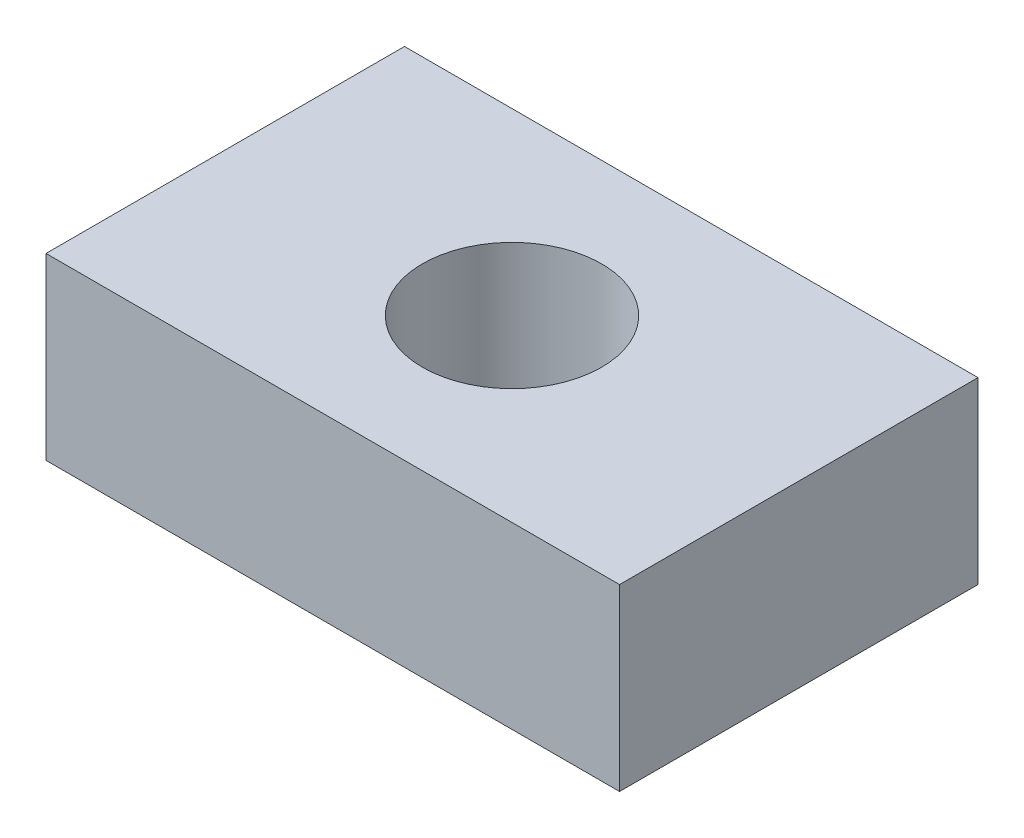
ISO-10303-21;
HEADER;
FILE_DESCRIPTION(('STEP AP214'),'2;1');
FILE_NAME('part.step','',(''),(''),'','','');
FILE_SCHEMA(('AUTOMOTIVE_DESIGN { 1 0 10303 214 1 1 1 1 }'));
ENDSEC;
DATA;
#1=APPLICATION_CONTEXT('core data for automotive mechanical design processes');
#2=APPLICATION_PROTOCOL_DEFINITION('international standard','automotive_design',2000,#1);
#3=PRODUCT_CONTEXT('',#1,'mechanical');
#4=PRODUCT('Part','Part','',(#3));
#5=PRODUCT_RELATED_PRODUCT_CATEGORY('part','',(#4));
#6=PRODUCT_DEFINITION_FORMATION('','',#4);
#7=PRODUCT_DEFINITION_CONTEXT('part definition',#1,'design');
#8=PRODUCT_DEFINITION('design','',#6,#7);
#9=PRODUCT_DEFINITION_SHAPE('','',#8);
#10=(LENGTH_UNIT() NAMED_UNIT(*) SI_UNIT(.MILLI.,.METRE.));
#11=(NAMED_UNIT(*) PLANE_ANGLE_UNIT() SI_UNIT($,.RADIAN.));
#12=(NAMED_UNIT(*) SI_UNIT($,.STERADIAN.) SOLID_ANGLE_UNIT());
#13=UNCERTAINTY_MEASURE_WITH_UNIT(LENGTH_MEASURE(1.E-05),#10,'distance_accuracy_value','');
#14=(GEOMETRIC_REPRESENTATION_CONTEXT(3) GLOBAL_UNCERTAINTY_ASSIGNED_CONTEXT((#13)) GLOBAL_UNIT_ASSIGNED_CONTEXT((#10,
#11,#12)) REPRESENTATION_CONTEXT('',''));
#15=CARTESIAN_POINT('',(0.,0.,0.));
#16=DIRECTION('',(0.,0.,1.));
#17=DIRECTION('',(1.,0.,0.));
#18=AXIS2_PLACEMENT_3D('',#15,#16,#17);
#19=CARTESIAN_POINT('',(0.,50.,0.));
#20=DIRECTION('',(0.,-1.,0.));
#21=DIRECTION('',(0.,0.,-1.));
#22=AXIS2_PLACEMENT_3D('',#19,#20,#21);
#23=PLANE('',#22);
#24=DIRECTION('',(0.,0.,-1.));
#25=VECTOR('',#24,1.);
#26=CARTESIAN_POINT('',(80.,50.,50.));
#27=LINE('',#26,#25);
#28=CARTESIAN_POINT('',(80.,50.,50.));
#29=VERTEX_POINT('',#28);
#30=CARTESIAN_POINT('',(80.,50.,-50.));
#31=VERTEX_POINT('',#30);
#32=EDGE_CURVE('E85',#29,#31,#27,.T.);
#33=ORIENTED_EDGE('',*,*,#32,.T.);
#34=DIRECTION('',(-1.,0.,0.));
#35=VECTOR('',#34,1.);
#36=CARTESIAN_POINT('',(-80.,50.,-50.));
#37=LINE('',#36,#35);
#38=CARTESIAN_POINT('',(-80.,50.,-50.));
#39=VERTEX_POINT('',#38);
#40=EDGE_CURVE('E80',#31,#39,#37,.T.);
#41=ORIENTED_EDGE('',*,*,#40,.T.);
#42=DIRECTION('',(0.,0.,1.));
#43=VECTOR('',#42,1.);
#44=CARTESIAN_POINT('',(-80.,50.,50.));
#45=LINE('',#44,#43);
#46=CARTESIAN_POINT('',(-80.,50.,50.));
#47=VERTEX_POINT('',#46);
#48=EDGE_CURVE('E83',#39,#47,#45,.T.);
#49=ORIENTED_EDGE('',*,*,#48,.T.);
#50=DIRECTION('',(1.,0.,0.));
#51=VECTOR('',#50,1.);
#52=CARTESIAN_POINT('',(-80.,50.,50.));
#53=LINE('',#52,#51);
#54=EDGE_CURVE('E50',#47,#29,#53,.T.);
#55=ORIENTED_EDGE('',*,*,#54,.T.);
#56=EDGE_LOOP('',(#33,#41,#49,#55));
#57=FACE_BOUND('',#56,.T.);
#58=CARTESIAN_POINT('',(0.,50.,0.));
#59=DIRECTION('',(0.,1.,0.));
#60=DIRECTION('',(0.,0.,1.));
#61=AXIS2_PLACEMENT_3D('',#58,#59,#60);
#62=CIRCLE('',#61,25.);
#63=CARTESIAN_POINT('',(0.,50.,25.));
#64=VERTEX_POINT('',#63);
#65=EDGE_CURVE('E100',#64,#64,#62,.T.);
#66=ORIENTED_EDGE('',*,*,#65,.F.);
#67=EDGE_LOOP('',(#66));
#68=FACE_BOUND('',#67,.T.);
#69=ADVANCED_FACE('F33',(#57,#68),#23,.F.);
#70=CARTESIAN_POINT('',(0.,0.,0.));
#71=DIRECTION('',(0.,-1.,0.));
#72=DIRECTION('',(0.,0.,-1.));
#73=AXIS2_PLACEMENT_3D('',#70,#71,#72);
#74=PLANE('',#73);
#75=DIRECTION('',(0.,0.,-1.));
#76=VECTOR('',#75,1.);
#77=CARTESIAN_POINT('',(80.,0.,50.));
#78=LINE('',#77,#76);
#79=CARTESIAN_POINT('',(80.,0.,50.));
#80=VERTEX_POINT('',#79);
#81=CARTESIAN_POINT('',(80.,0.,-50.));
#82=VERTEX_POINT('',#81);
#83=EDGE_CURVE('E97',#80,#82,#78,.T.);
#84=ORIENTED_EDGE('',*,*,#83,.F.);
#85=DIRECTION('',(1.,0.,0.));
#86=VECTOR('',#85,1.);
#87=CARTESIAN_POINT('',(-80.,0.,50.));
#88=LINE('',#87,#86);
#89=CARTESIAN_POINT('',(-80.,0.,50.));
#90=VERTEX_POINT('',#89);
#91=EDGE_CURVE('E73',#90,#80,#88,.T.);
#92=ORIENTED_EDGE('',*,*,#91,.F.);
#93=DIRECTION('',(0.,0.,1.));
#94=VECTOR('',#93,1.);
#95=CARTESIAN_POINT('',(-80.,0.,50.));
#96=LINE('',#95,#94);
#97=CARTESIAN_POINT('',(-80.,0.,-50.));
#98=VERTEX_POINT('',#97);
#99=EDGE_CURVE('E67',#98,#90,#96,.T.);
#100=ORIENTED_EDGE('',*,*,#99,.F.);
#101=DIRECTION('',(-1.,0.,0.));
#102=VECTOR('',#101,1.);
#103=CARTESIAN_POINT('',(-80.,0.,-50.));
#104=LINE('',#103,#102);
#105=EDGE_CURVE('E89',#82,#98,#104,.T.);
#106=ORIENTED_EDGE('',*,*,#105,.F.);
#107=EDGE_LOOP('',(#84,#92,#100,#106));
#108=FACE_BOUND('',#107,.T.);
#109=CARTESIAN_POINT('',(0.,0.,0.));
#110=DIRECTION('',(0.,1.,0.));
#111=DIRECTION('',(0.,0.,1.));
#112=AXIS2_PLACEMENT_3D('',#109,#110,#111);
#113=CIRCLE('',#112,25.);
#114=CARTESIAN_POINT('',(0.,0.,25.));
#115=VERTEX_POINT('',#114);
#116=EDGE_CURVE('E112',#115,#115,#113,.T.);
#117=ORIENTED_EDGE('',*,*,#116,.T.);
#118=EDGE_LOOP('',(#117));
#119=FACE_BOUND('',#118,.T.);
#120=ADVANCED_FACE('F108',(#108,#119),#74,.T.);
#121=CARTESIAN_POINT('',(80.,50.,50.));
#122=DIRECTION('',(-1.,0.,0.));
#123=DIRECTION('',(0.,0.,1.));
#124=AXIS2_PLACEMENT_3D('',#121,#122,#123);
#125=PLANE('',#124);
#126=ORIENTED_EDGE('',*,*,#83,.T.);
#127=DIRECTION('',(0.,-1.,0.));
#128=VECTOR('',#127,1.);
#129=CARTESIAN_POINT('',(80.,50.,-50.));
#130=LINE('',#129,#128);
#131=EDGE_CURVE('E11',#31,#82,#130,.T.);
#132=ORIENTED_EDGE('',*,*,#131,.F.);
#133=ORIENTED_EDGE('',*,*,#32,.F.);
#134=DIRECTION('',(0.,-1.,0.));
#135=VECTOR('',#134,1.);
#136=CARTESIAN_POINT('',(80.,50.,50.));
#137=LINE('',#136,#135);
#138=EDGE_CURVE('E93',#29,#80,#137,.T.);
#139=ORIENTED_EDGE('',*,*,#138,.T.);
#140=EDGE_LOOP('',(#126,#132,#133,#139));
#141=FACE_BOUND('',#140,.T.);
#142=ADVANCED_FACE('F35',(#141),#125,.F.);
#143=CARTESIAN_POINT('',(-80.,50.,-50.));
#144=DIRECTION('',(0.,0.,1.));
#145=DIRECTION('',(1.,0.,0.));
#146=AXIS2_PLACEMENT_3D('',#143,#144,#145);
#147=PLANE('',#146);
#148=ORIENTED_EDGE('',*,*,#105,.T.);
#149=DIRECTION('',(0.,-1.,0.));
#150=VECTOR('',#149,1.);
#151=CARTESIAN_POINT('',(-80.,50.,-50.));
#152=LINE('',#151,#150);
#153=EDGE_CURVE('E42',#39,#98,#152,.T.);
#154=ORIENTED_EDGE('',*,*,#153,.F.);
#155=ORIENTED_EDGE('',*,*,#40,.F.);
#156=ORIENTED_EDGE('',*,*,#131,.T.);
#157=EDGE_LOOP('',(#148,#154,#155,#156));
#158=FACE_BOUND('',#157,.T.);
#159=ADVANCED_FACE('F88',(#158),#147,.F.);
#160=CARTESIAN_POINT('',(-80.,50.,50.));
#161=DIRECTION('',(1.,0.,0.));
#162=DIRECTION('',(0.,0.,-1.));
#163=AXIS2_PLACEMENT_3D('',#160,#161,#162);
#164=PLANE('',#163);
#165=ORIENTED_EDGE('',*,*,#99,.T.);
#166=DIRECTION('',(0.,-1.,0.));
#167=VECTOR('',#166,1.);
#168=CARTESIAN_POINT('',(-80.,50.,50.));
#169=LINE('',#168,#167);
#170=EDGE_CURVE('E90',#47,#90,#169,.T.);
#171=ORIENTED_EDGE('',*,*,#170,.F.);
#172=ORIENTED_EDGE('',*,*,#48,.F.);
#173=ORIENTED_EDGE('',*,*,#153,.T.);
#174=EDGE_LOOP('',(#165,#171,#172,#173));
#175=FACE_BOUND('',#174,.T.);
#176=ADVANCED_FACE('F91',(#175),#164,.F.);
#177=CARTESIAN_POINT('',(-80.,50.,50.));
#178=DIRECTION('',(0.,0.,-1.));
#179=DIRECTION('',(-1.,0.,0.));
#180=AXIS2_PLACEMENT_3D('',#177,#178,#179);
#181=PLANE('',#180);
#182=ORIENTED_EDGE('',*,*,#91,.T.);
#183=ORIENTED_EDGE('',*,*,#138,.F.);
#184=ORIENTED_EDGE('',*,*,#54,.F.);
#185=ORIENTED_EDGE('',*,*,#170,.T.);
#186=EDGE_LOOP('',(#182,#183,#184,#185));
#187=FACE_BOUND('',#186,.T.);
#188=ADVANCED_FACE('F105',(#187),#181,.F.);
#189=CARTESIAN_POINT('',(0.,50.,0.));
#190=DIRECTION('',(0.,-1.,0.));
#191=DIRECTION('',(0.,0.,-1.));
#192=AXIS2_PLACEMENT_3D('',#189,#190,#191);
#193=CYLINDRICAL_SURFACE('',#192,25.);
#194=ORIENTED_EDGE('',*,*,#65,.T.);
#195=EDGE_LOOP('',(#194));
#196=FACE_BOUND('',#195,.T.);
#197=ORIENTED_EDGE('',*,*,#116,.F.);
#198=EDGE_LOOP('',(#197));
#199=FACE_BOUND('',#198,.T.);
#200=ADVANCED_FACE('F118',(#196,#199),#193,.F.);
#201=CLOSED_SHELL('',(#69,#120,#142,#159,#176,#188,#200));
#202=MANIFOLD_SOLID_BREP('B2',#201);
#203=ADVANCED_BREP_SHAPE_REPRESENTATION('',(#18,#202),#14);
#204=SHAPE_DEFINITION_REPRESENTATION(#9,#203);
ENDSEC;
END-ISO-10303-21;
